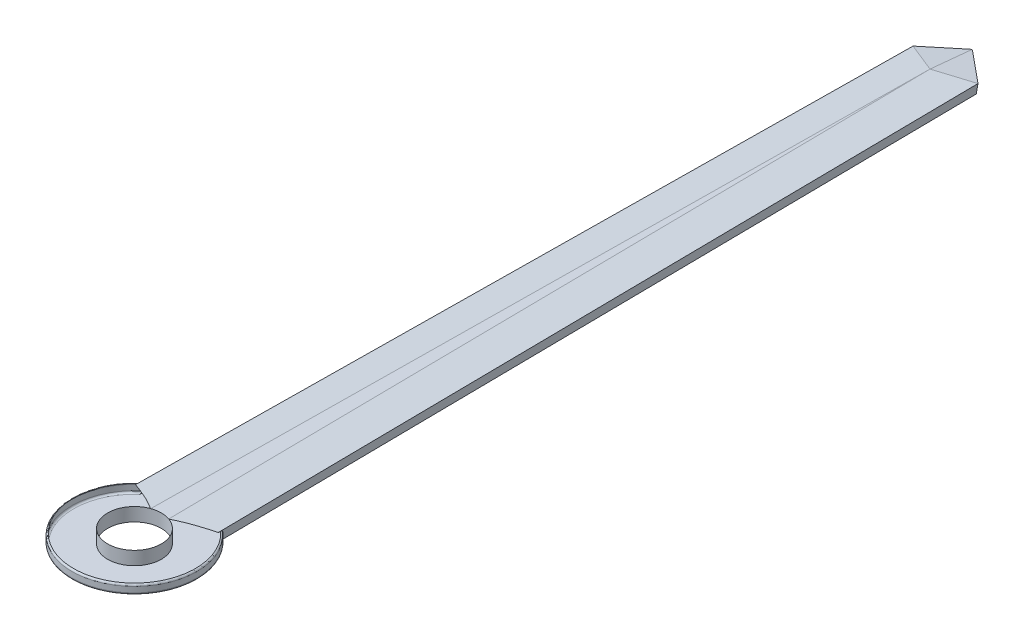
ISO-10303-21;
HEADER;
FILE_DESCRIPTION(('STEP AP214'),'2;1');
FILE_NAME('part.step','',(''),(''),'','','');
FILE_SCHEMA(('AUTOMOTIVE_DESIGN { 1 0 10303 214 1 1 1 1 }'));
ENDSEC;
DATA;
#1=APPLICATION_CONTEXT('core data for automotive mechanical design processes');
#2=APPLICATION_PROTOCOL_DEFINITION('international standard','automotive_design',2000,#1);
#3=PRODUCT_CONTEXT('',#1,'mechanical');
#4=PRODUCT('Part','Part','',(#3));
#5=PRODUCT_RELATED_PRODUCT_CATEGORY('part','',(#4));
#6=PRODUCT_DEFINITION_FORMATION('','',#4);
#7=PRODUCT_DEFINITION_CONTEXT('part definition',#1,'design');
#8=PRODUCT_DEFINITION('design','',#6,#7);
#9=PRODUCT_DEFINITION_SHAPE('','',#8);
#10=(LENGTH_UNIT() NAMED_UNIT(*) SI_UNIT(.MILLI.,.METRE.));
#11=(NAMED_UNIT(*) PLANE_ANGLE_UNIT() SI_UNIT($,.RADIAN.));
#12=(NAMED_UNIT(*) SI_UNIT($,.STERADIAN.) SOLID_ANGLE_UNIT());
#13=UNCERTAINTY_MEASURE_WITH_UNIT(LENGTH_MEASURE(1.E-05),#10,'distance_accuracy_value','');
#14=(GEOMETRIC_REPRESENTATION_CONTEXT(3) GLOBAL_UNCERTAINTY_ASSIGNED_CONTEXT((#13)) GLOBAL_UNIT_ASSIGNED_CONTEXT((#10,
#11,#12)) REPRESENTATION_CONTEXT('',''));
#15=CARTESIAN_POINT('',(0.,0.,0.));
#16=DIRECTION('',(0.,0.,1.));
#17=DIRECTION('',(1.,0.,0.));
#18=AXIS2_PLACEMENT_3D('',#15,#16,#17);
#19=CARTESIAN_POINT('',(0.,0.1905,0.));
#20=DIRECTION('',(0.,1.,0.));
#21=DIRECTION('',(0.,0.,1.));
#22=AXIS2_PLACEMENT_3D('',#19,#20,#21);
#23=PLANE('',#22);
#24=CARTESIAN_POINT('',(0.,0.1905,0.));
#25=DIRECTION('',(0.,1.,0.));
#26=DIRECTION('',(0.,0.,1.));
#27=AXIS2_PLACEMENT_3D('',#24,#25,#26);
#28=CIRCLE('',#27,0.380999999999999);
#29=CARTESIAN_POINT('',(0.127490264898993,0.1905,-0.359036533455837));
#30=VERTEX_POINT('',#29);
#31=CARTESIAN_POINT('',(-0.127490264898993,0.1905,-0.359036533455837));
#32=VERTEX_POINT('',#31);
#33=EDGE_CURVE('E159',#30,#32,#28,.T.);
#34=ORIENTED_EDGE('',*,*,#33,.F.);
#35=DIRECTION('',(-0.0116271209621439,0.,-0.999932402744371));
#36=VECTOR('',#35,1.);
#37=CARTESIAN_POINT('',(-0.00250040730988243,0.1905,-11.5382343434191));
#38=LINE('',#37,#36);
#39=CARTESIAN_POINT('',(0.000255235996342604,0.1905,-11.3012490190838));
#40=VERTEX_POINT('',#39);
#41=EDGE_CURVE('E198',#30,#40,#38,.T.);
#42=ORIENTED_EDGE('',*,*,#41,.T.);
#43=DIRECTION('',(-0.771288038730068,0.,-0.63648626168357));
#44=VECTOR('',#43,1.);
#45=CARTESIAN_POINT('',(-0.324948461460821,0.1905,-11.5696152782325));
#46=LINE('',#45,#44);
#47=CARTESIAN_POINT('',(0.,0.1905,-11.3014596462386));
#48=VERTEX_POINT('',#47);
#49=EDGE_CURVE('E194',#40,#48,#46,.T.);
#50=ORIENTED_EDGE('',*,*,#49,.T.);
#51=DIRECTION('',(-0.771288038730068,0.,0.63648626168357));
#52=VECTOR('',#51,1.);
#53=CARTESIAN_POINT('',(-0.183051538539177,0.1905,-11.1504009190061));
#54=LINE('',#53,#52);
#55=CARTESIAN_POINT('',(-0.000255235996342899,0.1905,-11.3012490190838));
#56=VERTEX_POINT('',#55);
#57=EDGE_CURVE('E191',#48,#56,#54,.T.);
#58=ORIENTED_EDGE('',*,*,#57,.T.);
#59=DIRECTION('',(-0.0116271209621439,0.,0.999932402744371));
#60=VECTOR('',#59,1.);
#61=CARTESIAN_POINT('',(-0.124499592690118,0.1905,-0.616234343419138));
#62=LINE('',#61,#60);
#63=EDGE_CURVE('E188',#56,#32,#62,.T.);
#64=ORIENTED_EDGE('',*,*,#63,.T.);
#65=EDGE_LOOP('',(#34,#42,#50,#58,#64));
#66=FACE_BOUND('',#65,.T.);
#67=ADVANCED_FACE('F36',(#66),#23,.T.);
#68=CARTESIAN_POINT('',(0.,0.,0.));
#69=DIRECTION('',(0.,1.,0.));
#70=DIRECTION('',(0.,0.,1.));
#71=AXIS2_PLACEMENT_3D('',#68,#69,#70);
#72=PLANE('',#71);
#73=DIRECTION('',(0.771288038730068,0.,-0.63648626168357));
#74=VECTOR('',#73,1.);
#75=CARTESIAN_POINT('',(-5.83257906208231,0.,-7.06786420437777));
#76=LINE('',#75,#74);
#77=CARTESIAN_POINT('',(-0.444847037542179,0.,-11.5139559924711));
#78=VERTEX_POINT('',#77);
#79=CARTESIAN_POINT('',(-0.0160431319088782,0.,-11.8678157454906));
#80=VERTEX_POINT('',#79);
#81=EDGE_CURVE('E153',#78,#80,#76,.T.);
#82=ORIENTED_EDGE('',*,*,#81,.T.);
#83=CARTESIAN_POINT('',(0.,0.,-11.8478692612338));
#84=DIRECTION('',(0.,1.,0.));
#85=DIRECTION('',(0.,0.,-1.));
#86=AXIS2_PLACEMENT_3D('',#83,#84,#85);
#87=ELLIPSE('',#86,0.0257281487250946,0.0254);
#88=CARTESIAN_POINT('',(0.0160431319088765,0.,-11.8678157454906));
#89=VERTEX_POINT('',#88);
#90=EDGE_CURVE('E336',#80,#89,#87,.F.);
#91=ORIENTED_EDGE('',*,*,#90,.T.);
#92=DIRECTION('',(0.771288038730068,0.,0.63648626168357));
#93=VECTOR('',#92,1.);
#94=CARTESIAN_POINT('',(5.83257906208231,0.,-7.06786420437777));
#95=LINE('',#94,#93);
#96=CARTESIAN_POINT('',(0.444847037542178,0.,-11.5139559924712));
#97=VERTEX_POINT('',#96);
#98=EDGE_CURVE('E178',#89,#97,#95,.T.);
#99=ORIENTED_EDGE('',*,*,#98,.T.);
#100=DIRECTION('',(0.0116271209621439,0.,0.999932402744371));
#101=VECTOR('',#100,1.);
#102=CARTESIAN_POINT('',(0.578652008248543,0.,-0.00672851172382027));
#103=LINE('',#102,#101);
#104=CARTESIAN_POINT('',(0.571198656038301,0.,-0.647716801804646));
#105=VERTEX_POINT('',#104);
#106=EDGE_CURVE('E182',#97,#105,#103,.T.);
#107=ORIENTED_EDGE('',*,*,#106,.T.);
#108=CARTESIAN_POINT('',(0.,0.,0.));
#109=DIRECTION('',(0.,1.,0.));
#110=DIRECTION('',(0.,0.,1.));
#111=AXIS2_PLACEMENT_3D('',#108,#109,#110);
#112=CIRCLE('',#111,0.8636);
#113=CARTESIAN_POINT('',(-0.571198656038301,0.,-0.647716801804646));
#114=VERTEX_POINT('',#113);
#115=EDGE_CURVE('E156',#105,#114,#112,.F.);
#116=ORIENTED_EDGE('',*,*,#115,.T.);
#117=DIRECTION('',(0.0116271209621439,0.,-0.999932402744371));
#118=VECTOR('',#117,1.);
#119=CARTESIAN_POINT('',(-0.578652008248543,0.,-0.00672851172382027));
#120=LINE('',#119,#118);
#121=EDGE_CURVE('E148',#114,#78,#120,.T.);
#122=ORIENTED_EDGE('',*,*,#121,.T.);
#123=EDGE_LOOP('',(#82,#91,#99,#107,#116,#122));
#124=FACE_BOUND('',#123,.T.);
#125=CARTESIAN_POINT('',(0.,0.,0.));
#126=DIRECTION('',(0.,1.,0.));
#127=DIRECTION('',(0.,0.,1.));
#128=AXIS2_PLACEMENT_3D('',#125,#126,#127);
#129=CIRCLE('',#128,0.380999999999999);
#130=CARTESIAN_POINT('',(0.,0.,0.380999999999999));
#131=VERTEX_POINT('',#130);
#132=EDGE_CURVE('E231',#131,#131,#129,.T.);
#133=ORIENTED_EDGE('',*,*,#132,.T.);
#134=EDGE_LOOP('',(#133));
#135=FACE_BOUND('',#134,.T.);
#136=ADVANCED_FACE('F150',(#124,#135),#72,.F.);
#137=CARTESIAN_POINT('',(0.,0.1905,0.));
#138=DIRECTION('',(0.,-1.,0.));
#139=DIRECTION('',(0.,0.,-1.));
#140=AXIS2_PLACEMENT_3D('',#137,#138,#139);
#141=CYLINDRICAL_SURFACE('',#140,0.889);
#142=CARTESIAN_POINT('',(0.,-4.65263034160604,0.));
#143=DIRECTION('',(-0.992286414925699,0.123428280262923,0.011538214127043));
#144=DIRECTION('',(-0.12341993684991,-0.992353495298595,0.0014351155447664));
#145=AXIS2_PLACEMENT_3D('',#142,#143,#144);
#146=ELLIPSE('',#145,7.20256328700588,0.889);
#147=CARTESIAN_POINT('',(0.573995985884059,0.0254000000000018,-0.678859048837818));
#148=VERTEX_POINT('',#147);
#149=CARTESIAN_POINT('',(0.583942218372925,0.10456351765091,-0.670322672749257));
#150=VERTEX_POINT('',#149);
#151=EDGE_CURVE('E201',#148,#150,#146,.F.);
#152=ORIENTED_EDGE('',*,*,#151,.T.);
#153=CARTESIAN_POINT('',(0.,0.104563517650909,0.));
#154=DIRECTION('',(0.,1.,0.));
#155=DIRECTION('',(0.,0.,1.));
#156=AXIS2_PLACEMENT_3D('',#153,#154,#155);
#157=CIRCLE('',#156,0.889);
#158=CARTESIAN_POINT('',(-0.583942218372925,0.104563517650912,-0.670322672749257));
#159=VERTEX_POINT('',#158);
#160=EDGE_CURVE('E333',#150,#159,#157,.F.);
#161=ORIENTED_EDGE('',*,*,#160,.T.);
#162=CARTESIAN_POINT('',(0.,-4.65263034160604,0.));
#163=DIRECTION('',(0.992286414925699,0.123428280262923,0.011538214127043));
#164=DIRECTION('',(0.12341993684991,-0.992353495298595,0.0014351155447664));
#165=AXIS2_PLACEMENT_3D('',#162,#163,#164);
#166=ELLIPSE('',#165,7.20256328700589,0.889);
#167=CARTESIAN_POINT('',(-0.573995985884059,0.0253999999999992,-0.678859048837818));
#168=VERTEX_POINT('',#167);
#169=EDGE_CURVE('E204',#159,#168,#166,.F.);
#170=ORIENTED_EDGE('',*,*,#169,.T.);
#171=CARTESIAN_POINT('',(0.,0.0254,0.));
#172=DIRECTION('',(0.,1.,0.));
#173=DIRECTION('',(0.,0.,1.));
#174=AXIS2_PLACEMENT_3D('',#171,#172,#173);
#175=CIRCLE('',#174,0.889);
#176=EDGE_CURVE('E335',#168,#148,#175,.T.);
#177=ORIENTED_EDGE('',*,*,#176,.T.);
#178=EDGE_LOOP('',(#152,#161,#170,#177));
#179=FACE_BOUND('',#178,.T.);
#180=ADVANCED_FACE('F310',(#179),#141,.T.);
#181=CARTESIAN_POINT('',(0.,0.1905,0.));
#182=DIRECTION('',(0.,-1.,0.));
#183=DIRECTION('',(0.,0.,-1.));
#184=AXIS2_PLACEMENT_3D('',#181,#182,#183);
#185=CYLINDRICAL_SURFACE('',#184,0.380999999999999);
#186=CARTESIAN_POINT('',(0.,0.190184708544504,0.));
#187=DIRECTION('',(0.,-1.,0.));
#188=DIRECTION('',(0.,0.,-1.));
#189=AXIS2_PLACEMENT_3D('',#186,#187,#188);
#190=CIRCLE('',#189,0.380999999999999);
#191=CARTESIAN_POINT('',(-0.130035983962558,0.190184708544504,-0.358122385330614));
#192=VERTEX_POINT('',#191);
#193=CARTESIAN_POINT('',(0.13003598396265,0.190184708544504,-0.358122385330581));
#194=VERTEX_POINT('',#193);
#195=EDGE_CURVE('E234',#192,#194,#190,.F.);
#196=ORIENTED_EDGE('',*,*,#195,.T.);
#197=CARTESIAN_POINT('',(0.,0.206875313262966,0.));
#198=DIRECTION('',(0.123419936849913,0.992353495298594,-0.00143511554476643));
#199=DIRECTION('',(0.992286414925698,-0.123428280262926,-0.011538214127043));
#200=AXIS2_PLACEMENT_3D('',#197,#198,#199);
#201=ELLIPSE('',#200,0.383935766644686,0.380999999999999);
#202=EDGE_CURVE('E237',#194,#30,#201,.T.);
#203=ORIENTED_EDGE('',*,*,#202,.T.);
#204=ORIENTED_EDGE('',*,*,#33,.T.);
#205=CARTESIAN_POINT('',(0.,0.206875313262966,0.));
#206=DIRECTION('',(-0.123419936849913,0.992353495298594,-0.00143511554476643));
#207=DIRECTION('',(-0.992286414925698,-0.123428280262926,-0.011538214127043));
#208=AXIS2_PLACEMENT_3D('',#205,#206,#207);
#209=ELLIPSE('',#208,0.383935766644686,0.380999999999999);
#210=EDGE_CURVE('E207',#32,#192,#209,.T.);
#211=ORIENTED_EDGE('',*,*,#210,.T.);
#212=EDGE_LOOP('',(#196,#203,#204,#211));
#213=FACE_BOUND('',#212,.T.);
#214=ORIENTED_EDGE('',*,*,#132,.F.);
#215=EDGE_LOOP('',(#214));
#216=FACE_BOUND('',#215,.T.);
#217=ADVANCED_FACE('F314',(#213,#216),#185,.F.);
#218=CARTESIAN_POINT('',(-0.131647308512932,0.1905,-0.00153078265712711));
#219=DIRECTION('',(-0.123419936849913,0.992353495298594,-0.00143511554476643));
#220=DIRECTION('',(-0.992354517204281,-0.123420063945284,0.));
#221=AXIS2_PLACEMENT_3D('',#218,#219,#220);
#222=PLANE('',#221);
#223=DIRECTION('',(-0.0116271209621439,0.,0.999932402744371));
#224=VECTOR('',#223,1.);
#225=CARTESIAN_POINT('',(-0.588026098472768,0.132842978192118,-0.621624186509634));
#226=LINE('',#225,#224);
#227=CARTESIAN_POINT('',(-0.588248862316324,0.132842978192118,-0.602466495963819));
#228=VERTEX_POINT('',#227);
#229=CARTESIAN_POINT('',(-0.461279660106525,0.132842978192118,-11.5218178860066));
#230=VERTEX_POINT('',#229);
#231=EDGE_CURVE('E166',#228,#230,#226,.F.);
#232=ORIENTED_EDGE('',*,*,#231,.F.);
#233=CARTESIAN_POINT('',(-0.588248862316324,0.132842978192118,-0.602466495963819));
#234=CARTESIAN_POINT('',(-0.548193220507443,0.137849566828459,-0.585296484566291));
#235=CARTESIAN_POINT('',(-0.508362668731256,0.142828974169535,-0.567564048589156));
#236=CARTESIAN_POINT('',(-0.429495899396567,0.15269108663912,-0.530654066274168));
#237=CARTESIAN_POINT('',(-0.390457882077916,0.157574009984259,-0.511480406905702));
#238=CARTESIAN_POINT('',(-0.313215901142291,0.167238871748706,-0.4712335121522));
#239=CARTESIAN_POINT('',(-0.27501417868527,0.172020537903475,-0.450155802456047));
#240=CARTESIAN_POINT('',(-0.200026951377842,0.181411521945662,-0.405381024593189));
#241=CARTESIAN_POINT('',(-0.163245533047501,0.186020341559049,-0.381677062156839));
#242=CARTESIAN_POINT('',(-0.127521687784073,0.190500000000005,-0.356334165335821));
#243=B_SPLINE_CURVE_WITH_KNOTS('',3,(#233,#234,#235,#236,#237,#238,#239,#240,#241,#242),
.UNSPECIFIED.,.F.,.F.,(4,2,2,2,4),(0.,0.131612085498327,0.262881139686943,0.394467111305991,
0.526407086773529),.UNSPECIFIED.);
#244=EDGE_CURVE('E353',#228,#192,#243,.T.);
#245=ORIENTED_EDGE('',*,*,#244,.T.);
#246=ORIENTED_EDGE('',*,*,#210,.F.);
#247=ORIENTED_EDGE('',*,*,#63,.F.);
#248=DIRECTION('',(-0.896387779973205,-0.112104797653588,-0.428860655991847));
#249=VECTOR('',#248,1.);
#250=CARTESIAN_POINT('',(4.23806906466026,0.72055685567199,-9.27349877471953));
#251=LINE('',#250,#249);
#252=EDGE_CURVE('E227',#230,#56,#251,.F.);
#253=ORIENTED_EDGE('',*,*,#252,.F.);
#254=EDGE_LOOP('',(#232,#245,#246,#247,#253));
#255=FACE_BOUND('',#254,.T.);
#256=ADVANCED_FACE('F357',(#255),#222,.T.);
#257=CARTESIAN_POINT('',(-5.5480474782384,0.1905,-6.72307151917629));
#258=DIRECTION('',(-0.0785604046905817,0.992353495298594,-0.0951987562078173));
#259=DIRECTION('',(0.,0.0954938938986421,0.995430015735951));
#260=AXIS2_PLACEMENT_3D('',#257,#258,#259);
#261=PLANE('',#260);
#262=DIRECTION('',(0.,-0.0954938938986422,-0.99543001573595));
#263=VECTOR('',#262,1.);
#264=CARTESIAN_POINT('',(0.,0.625710075849527,-6.76482222404737));
#265=LINE('',#264,#263);
#266=CARTESIAN_POINT('',(0.,0.133547497242996,-11.8951335284219));
#267=VERTEX_POINT('',#266);
#268=EDGE_CURVE('E222',#267,#48,#265,.F.);
#269=ORIENTED_EDGE('',*,*,#268,.F.);
#270=CARTESIAN_POINT('',(0.,0.135978056510796,-11.8697973362172));
#271=DIRECTION('',(-0.0785604046905817,0.992353495298594,-0.0951987562078173));
#272=DIRECTION('',(0.771288038730088,0.,-0.636486261683545));
#273=AXIS2_PLACEMENT_3D('',#270,#271,#272);
#274=ELLIPSE('',#273,0.0255314183149097,0.0254);
#275=CARTESIAN_POINT('',(-0.0160431319088771,0.132842978192118,-11.8892382518975));
#276=VERTEX_POINT('',#275);
#277=EDGE_CURVE('E344',#267,#276,#274,.T.);
#278=ORIENTED_EDGE('',*,*,#277,.T.);
#279=DIRECTION('',(-0.771288038730068,0.,0.63648626168357));
#280=VECTOR('',#279,1.);
#281=CARTESIAN_POINT('',(-0.478099735844441,0.132842978192118,-11.5079375370448));
#282=LINE('',#281,#280);
#283=EDGE_CURVE('E171',#230,#276,#282,.F.);
#284=ORIENTED_EDGE('',*,*,#283,.F.);
#285=ORIENTED_EDGE('',*,*,#252,.T.);
#286=ORIENTED_EDGE('',*,*,#57,.F.);
#287=EDGE_LOOP('',(#269,#278,#284,#285,#286));
#288=FACE_BOUND('',#287,.T.);
#289=ADVANCED_FACE('F273',(#288),#261,.T.);
#290=CARTESIAN_POINT('',(-0.635,0.510534918069288,-0.622170394666927));
#291=DIRECTION('',(0.992286414925699,0.123428280262923,0.011538214127043));
#292=DIRECTION('',(-0.123436497110616,0.992352473257895,0.));
#293=AXIS2_PLACEMENT_3D('',#290,#291,#292);
#294=PLANE('',#293);
#295=ORIENTED_EDGE('',*,*,#169,.F.);
#296=CARTESIAN_POINT('',(-0.583942218372925,0.104563517650909,-0.670322672749257));
#297=CARTESIAN_POINT('',(-0.584104249927129,0.105853117583221,-0.670183257053217));
#298=CARTESIAN_POINT('',(-0.584265342745076,0.107122761098843,-0.669911091961102));
#299=CARTESIAN_POINT('',(-0.584580049900082,0.109580953005702,-0.669142408447812));
#300=CARTESIAN_POINT('',(-0.584733719672291,0.110770143439963,-0.668647990760664));
#301=CARTESIAN_POINT('',(-0.585030417453713,0.113045736475916,-0.667474789891916));
#302=CARTESIAN_POINT('',(-0.585173493052339,0.11413260555371,-0.666796904077463));
#303=CARTESIAN_POINT('',(-0.585448283233792,0.116200939100631,-0.665290630133141));
#304=CARTESIAN_POINT('',(-0.585579966831143,0.117182117770456,-0.664461849459796));
#305=CARTESIAN_POINT('',(-0.585892627948483,0.119488657882759,-0.662246853316463));
#306=CARTESIAN_POINT('',(-0.586065857048017,0.120744880618033,-0.660787401263488));
#307=CARTESIAN_POINT('',(-0.586383512277623,0.12300849941694,-0.657683767282133));
#308=CARTESIAN_POINT('',(-0.586527875948282,0.12401535699983,-0.656039196547951));
#309=CARTESIAN_POINT('',(-0.586826626763701,0.126050538582397,-0.652117670016126));
#310=CARTESIAN_POINT('',(-0.586971339698861,0.126997056242895,-0.649797585447162));
#311=CARTESIAN_POINT('',(-0.587213829203313,0.128501539785394,-0.645037470572332));
#312=CARTESIAN_POINT('',(-0.587311663284962,0.129059982150471,-0.6425975913086));
#313=CARTESIAN_POINT('',(-0.587414829502616,0.129570068732687,-0.639181869759658));
#314=CARTESIAN_POINT('',(-0.587440036875009,0.12968364766395,-0.638229028973402));
#315=CARTESIAN_POINT('',(-0.587461793826662,0.129769296430835,-0.637274145710641));
#316=B_SPLINE_CURVE_WITH_KNOTS('',3,(#296,#297,#298,#299,#300,#301,#302,#303,#304,#305,#306,
#307,#308,#309,#310,#311,#312,#313,#314,#315),.UNSPECIFIED.,.F.,.F.,(4,2,2,2,2,2,2,2,2,4),(0.,
0.00390675921132828,0.00777734379610161,0.0116293286702409,0.0154914812627117,0.021259819248556,
0.027040506893482,0.0345317102156363,0.0420136994279959,0.044891536435234),.UNSPECIFIED.);
#317=CARTESIAN_POINT('',(-0.587461793826662,0.129769296430836,-0.637274145710624));
#318=VERTEX_POINT('',#317);
#319=EDGE_CURVE('E64',#159,#318,#316,.T.);
#320=ORIENTED_EDGE('',*,*,#319,.T.);
#321=CARTESIAN_POINT('',(-0.586761723930837,0.126999999999996,-0.667856031888394));
#322=CARTESIAN_POINT('',(-0.58701258294032,0.127998178635317,-0.656960020301663));
#323=CARTESIAN_POINT('',(-0.587261940639642,0.128984182785995,-0.646062886702011));
#324=CARTESIAN_POINT('',(-0.587757653435011,0.130931842185044,-0.624266374727307));
#325=CARTESIAN_POINT('',(-0.588004008530851,0.13189349743174,-0.613366996352101));
#326=CARTESIAN_POINT('',(-0.588248862316324,0.132842978192118,-0.602466495963819));
#327=B_SPLINE_CURVE_WITH_KNOTS('',3,(#321,#322,#323,#324,#325,#326),.UNSPECIFIED.,.F.,.F.,(4,2,
4),(0.,0.0328334758626683,0.0656669539835402),.UNSPECIFIED.);
#328=EDGE_CURVE('E276',#318,#228,#327,.T.);
#329=ORIENTED_EDGE('',*,*,#328,.T.);
#330=ORIENTED_EDGE('',*,*,#231,.T.);
#331=DIRECTION('',(0.122552715498221,-0.990728512662257,0.0586331486622009));
#332=VECTOR('',#331,1.);
#333=CARTESIAN_POINT('',(-0.431425747715019,-0.10849906062395,-11.5075348170735));
#334=LINE('',#333,#332);
#335=EDGE_CURVE('E163',#78,#230,#334,.F.);
#336=ORIENTED_EDGE('',*,*,#335,.F.);
#337=ORIENTED_EDGE('',*,*,#121,.F.);
#338=CARTESIAN_POINT('',(-0.571198656038301,0.,-0.647716801804646));
#339=CARTESIAN_POINT('',(-0.571173985481209,1.23472504545118E-06,-0.649851677996783));
#340=CARTESIAN_POINT('',(-0.571167424126858,0.000148735256892394,-0.651993818842631));
#341=CARTESIAN_POINT('',(-0.571194916383691,0.000767562435153503,-0.656249293813108));
#342=CARTESIAN_POINT('',(-0.571229335994081,0.00124179104113898,-0.658362195274561));
#343=CARTESIAN_POINT('',(-0.571331697233564,0.0024085772214167,-0.662040645322824));
#344=CARTESIAN_POINT('',(-0.571391019168623,0.00303383097806176,-0.663627515304839));
#345=CARTESIAN_POINT('',(-0.571540624321738,0.00452200713404006,-0.666681008872747));
#346=CARTESIAN_POINT('',(-0.571630810317335,0.0053841815676792,-0.668147992341435));
#347=CARTESIAN_POINT('',(-0.571821781332556,0.00714969432872987,-0.670610787668139));
#348=CARTESIAN_POINT('',(-0.571916314353619,0.00800595859600489,-0.671640703846419));
#349=CARTESIAN_POINT('',(-0.572126406192652,0.00987320945937861,-0.673547436108814));
#350=CARTESIAN_POINT('',(-0.572241942151081,0.0108840276511603,-0.674424416634072));
#351=CARTESIAN_POINT('',(-0.572473946009436,0.012883518496956,-0.675861332213842));
#352=CARTESIAN_POINT('',(-0.572587628248466,0.01385240366094,-0.676449160458318));
#353=CARTESIAN_POINT('',(-0.572827391264135,0.0158738370221022,-0.677453515210049));
#354=CARTESIAN_POINT('',(-0.572953463101079,0.0169263247923461,-0.677870164123105));
#355=CARTESIAN_POINT('',(-0.57322821264777,0.01919795402351,-0.678542109245978));
#356=CARTESIAN_POINT('',(-0.573377885937935,0.0204231663936128,-0.678776728161864));
#357=CARTESIAN_POINT('',(-0.573683739734442,0.0229032812319451,-0.679003950684685));
#358=CARTESIAN_POINT('',(-0.573839956844846,0.0241583268090005,-0.678994937226952));
#359=CARTESIAN_POINT('',(-0.573995985881224,0.0253999999827562,-0.678859048897214));
#360=B_SPLINE_CURVE_WITH_KNOTS('',3,(#338,#339,#340,#341,#342,#343,#344,#345,#346,#347,#348,
#349,#350,#351,#352,#353,#354,#355,#356,#357,#358,#359),.UNSPECIFIED.,.F.,.F.,(4,2,2,2,2,2,2,2,
2,2,4),(0.,0.00641153917337711,0.0128807716605205,0.0179830909363638,0.0230694835189735,
0.0270826019222974,0.0310913783286584,0.0344936441983647,0.0378934729457264,0.0416384890004196,
0.0454083679706358),.UNSPECIFIED.);
#361=EDGE_CURVE('E11',#114,#168,#360,.T.);
#362=ORIENTED_EDGE('',*,*,#361,.T.);
#363=EDGE_LOOP('',(#295,#320,#329,#330,#336,#337,#362));
#364=FACE_BOUND('',#363,.T.);
#365=ADVANCED_FACE('F164',(#364),#294,.F.);
#366=CARTESIAN_POINT('',(5.5480474782384,0.1905,-6.72307151917629));
#367=DIRECTION('',(0.0785604046905819,0.992353495298594,-0.0951987562078176));
#368=DIRECTION('',(0.,0.0954938938986423,0.995430015735951));
#369=AXIS2_PLACEMENT_3D('',#366,#367,#368);
#370=PLANE('',#369);
#371=DIRECTION('',(-0.771288038730068,0.,-0.63648626168357));
#372=VECTOR('',#371,1.);
#373=CARTESIAN_POINT('',(-0.0299002641555591,0.132842978192118,-11.9271518962712));
#374=LINE('',#373,#372);
#375=CARTESIAN_POINT('',(0.0160431319088775,0.132842978192118,-11.8892382518975));
#376=VERTEX_POINT('',#375);
#377=CARTESIAN_POINT('',(0.461279660106525,0.132842978192118,-11.5218178860066));
#378=VERTEX_POINT('',#377);
#379=EDGE_CURVE('E215',#376,#378,#374,.F.);
#380=ORIENTED_EDGE('',*,*,#379,.F.);
#381=CARTESIAN_POINT('',(0.,0.135978056510797,-11.8697973362172));
#382=DIRECTION('',(0.0785604046905819,0.992353495298594,-0.0951987562078176));
#383=DIRECTION('',(-0.771288038730095,0.,-0.636486261683536));
#384=AXIS2_PLACEMENT_3D('',#381,#382,#383);
#385=ELLIPSE('',#384,0.0255314183149097,0.0254);
#386=EDGE_CURVE('E347',#376,#267,#385,.T.);
#387=ORIENTED_EDGE('',*,*,#386,.T.);
#388=ORIENTED_EDGE('',*,*,#268,.T.);
#389=ORIENTED_EDGE('',*,*,#49,.F.);
#390=DIRECTION('',(0.896387779973206,-0.112104797653588,-0.428860655991844));
#391=VECTOR('',#390,1.);
#392=CARTESIAN_POINT('',(2.69799966558342,-0.146887568368004,-12.5919364555029));
#393=LINE('',#392,#391);
#394=EDGE_CURVE('E172',#378,#40,#393,.F.);
#395=ORIENTED_EDGE('',*,*,#394,.F.);
#396=EDGE_LOOP('',(#380,#387,#388,#389,#395));
#397=FACE_BOUND('',#396,.T.);
#398=ADVANCED_FACE('F267',(#397),#370,.T.);
#399=CARTESIAN_POINT('',(-0.508,0.510534918069288,-11.5441703946669));
#400=DIRECTION('',(0.631619366491226,0.123428280262923,0.76539038111578));
#401=DIRECTION('',(0.771288038730068,0.,-0.63648626168357));
#402=AXIS2_PLACEMENT_3D('',#399,#400,#401);
#403=PLANE('',#402);
#404=ORIENTED_EDGE('',*,*,#283,.T.);
#405=DIRECTION('',(0.,-0.987245536839792,0.159205056420677));
#406=VECTOR('',#405,1.);
#407=CARTESIAN_POINT('',(-0.0160431319088775,0.446725982236157,-11.9398556105014));
#408=LINE('',#407,#406);
#409=EDGE_CURVE('E176',#276,#80,#408,.T.);
#410=ORIENTED_EDGE('',*,*,#409,.T.);
#411=ORIENTED_EDGE('',*,*,#81,.F.);
#412=ORIENTED_EDGE('',*,*,#335,.T.);
#413=EDGE_LOOP('',(#404,#410,#411,#412));
#414=FACE_BOUND('',#413,.T.);
#415=ADVANCED_FACE('F174',(#414),#403,.F.);
#416=CARTESIAN_POINT('',(0.131647308512932,0.1905,-0.00153078265712711));
#417=DIRECTION('',(0.123419936849913,0.992353495298594,-0.00143511554476643));
#418=DIRECTION('',(-0.992354517204281,0.123420063945284,0.));
#419=AXIS2_PLACEMENT_3D('',#416,#417,#418);
#420=PLANE('',#419);
#421=ORIENTED_EDGE('',*,*,#41,.F.);
#422=ORIENTED_EDGE('',*,*,#202,.F.);
#423=CARTESIAN_POINT('',(0.12752168778411,0.1905,-0.356334165335732));
#424=CARTESIAN_POINT('',(0.179523864309788,0.183979439635741,-0.392983148835548));
#425=CARTESIAN_POINT('',(0.233528599182533,0.177214511526552,-0.426387488425012));
#426=CARTESIAN_POINT('',(0.344031744034589,0.163381590620062,-0.488303236401294));
#427=CARTESIAN_POINT('',(0.400521244071694,0.156314682916234,-0.516830579535874));
#428=CARTESIAN_POINT('',(0.479249261012418,0.146469448175179,-0.554002658378174));
#429=CARTESIAN_POINT('',(0.500910347290855,0.143761029718878,-0.563966052133203));
#430=CARTESIAN_POINT('',(0.544436428431832,0.138319396069531,-0.583503145451653));
#431=CARTESIAN_POINT('',(0.566301637923232,0.135586154884375,-0.593076359953089));
#432=CARTESIAN_POINT('',(0.58824886231639,0.13284297819211,-0.602466495963848));
#433=B_SPLINE_CURVE_WITH_KNOTS('',3,(#423,#424,#425,#426,#427,#428,#429,#430,#431,#432),
.UNSPECIFIED.,.F.,.F.,(4,2,2,2,4),(0.,0.191458446972412,0.382278857510023,0.454267917685656,
0.526343901008368),.UNSPECIFIED.);
#434=CARTESIAN_POINT('',(0.588248862316322,0.132842978192118,-0.602466495963993));
#435=VERTEX_POINT('',#434);
#436=EDGE_CURVE('E240',#194,#435,#433,.T.);
#437=ORIENTED_EDGE('',*,*,#436,.T.);
#438=DIRECTION('',(-0.0116271209621439,0.,-0.999932402744371));
#439=VECTOR('',#438,1.);
#440=CARTESIAN_POINT('',(0.461026098472768,0.132842978192118,-11.5436241865096));
#441=LINE('',#440,#439);
#442=EDGE_CURVE('E212',#378,#435,#441,.F.);
#443=ORIENTED_EDGE('',*,*,#442,.F.);
#444=ORIENTED_EDGE('',*,*,#394,.T.);
#445=EDGE_LOOP('',(#421,#422,#437,#443,#444));
#446=FACE_BOUND('',#445,.T.);
#447=ADVANCED_FACE('F258',(#446),#420,.T.);
#448=CARTESIAN_POINT('',(0.,0.510534918069288,-11.9633847538934));
#449=DIRECTION('',(-0.631619366491226,0.123428280262922,0.765390381115781));
#450=DIRECTION('',(0.771288038730068,0.,0.63648626168357));
#451=AXIS2_PLACEMENT_3D('',#448,#449,#450);
#452=PLANE('',#451);
#453=ORIENTED_EDGE('',*,*,#98,.F.);
#454=DIRECTION('',(0.,-0.987245536839792,0.159205056420677));
#455=VECTOR('',#454,1.);
#456=CARTESIAN_POINT('',(0.0160431319088772,0.512615781740341,-11.9504811224497));
#457=LINE('',#456,#455);
#458=EDGE_CURVE('E350',#89,#376,#457,.F.);
#459=ORIENTED_EDGE('',*,*,#458,.T.);
#460=ORIENTED_EDGE('',*,*,#379,.T.);
#461=DIRECTION('',(-0.122552715498221,-0.990728512662257,0.0586331486621997));
#462=VECTOR('',#461,1.);
#463=CARTESIAN_POINT('',(0.503382590942968,0.473207317543837,-11.54196127812));
#464=LINE('',#463,#462);
#465=EDGE_CURVE('E208',#97,#378,#464,.F.);
#466=ORIENTED_EDGE('',*,*,#465,.F.);
#467=EDGE_LOOP('',(#453,#459,#460,#466));
#468=FACE_BOUND('',#467,.T.);
#469=ADVANCED_FACE('F263',(#468),#452,.F.);
#470=CARTESIAN_POINT('',(0.508,0.510534918069288,-11.5441703946669));
#471=DIRECTION('',(-0.992286414925699,0.123428280262923,0.011538214127043));
#472=DIRECTION('',(-0.123436497110616,-0.992352473257895,0.));
#473=AXIS2_PLACEMENT_3D('',#470,#471,#472);
#474=PLANE('',#473);
#475=ORIENTED_EDGE('',*,*,#151,.F.);
#476=CARTESIAN_POINT('',(0.573995985884059,0.0254,-0.678859048837818));
#477=CARTESIAN_POINT('',(0.573858614463925,0.0243066949276383,-0.678977527234792));
#478=CARTESIAN_POINT('',(0.573721079368415,0.0232030134282763,-0.678999081473847));
#479=CARTESIAN_POINT('',(0.573450269253389,0.0210120665416885,-0.678851432264446));
#480=CARTESIAN_POINT('',(0.57331698049174,0.0199247558748869,-0.678682926268013));
#481=CARTESIAN_POINT('',(0.573058068766036,0.0177942742207744,-0.678158833150036));
#482=CARTESIAN_POINT('',(0.572932452849961,0.0167511440777955,-0.677803076828158));
#483=CARTESIAN_POINT('',(0.572692266004709,0.0147378799519829,-0.67692256056593));
#484=CARTESIAN_POINT('',(0.572577698223088,0.0137677667884891,-0.676397752647394));
#485=CARTESIAN_POINT('',(0.572360265568612,0.0119073525967855,-0.675195464762214));
#486=CARTESIAN_POINT('',(0.572257583744161,0.0110183357882597,-0.674515980376457));
#487=CARTESIAN_POINT('',(0.572066752669052,0.00934584964164512,-0.673036288174918));
#488=CARTESIAN_POINT('',(0.571978612818721,0.00856244863584311,-0.672236002905154));
#489=CARTESIAN_POINT('',(0.571779938113091,0.00677032237312034,-0.67015103109142));
#490=CARTESIAN_POINT('',(0.571677677101408,0.00582308393554493,-0.668812539838825));
#491=CARTESIAN_POINT('',(0.571502952062893,0.00415535246470472,-0.665998590906806));
#492=CARTESIAN_POINT('',(0.57143055914319,0.00343540148101112,-0.664522816506595));
#493=CARTESIAN_POINT('',(0.571294391968452,0.00201050713227311,-0.66099060424902));
#494=CARTESIAN_POINT('',(0.571241055841017,0.00138640417116661,-0.658901265270516));
#495=CARTESIAN_POINT('',(0.571177808115013,0.000480809591655116,-0.654653110249635));
#496=CARTESIAN_POINT('',(0.571167870533442,0.000199113045151655,-0.652494336558481));
#497=CARTESIAN_POINT('',(0.571181480540977,2.47222675849728E-05,-0.649458357249416));
#498=CARTESIAN_POINT('',(0.5711885494495,1.20562527707044E-07,-0.648587258140736));
#499=CARTESIAN_POINT('',(0.571198656038301,0.,-0.647716801804646));
#500=B_SPLINE_CURVE_WITH_KNOTS('',3,(#476,#477,#478,#479,#480,#481,#482,#483,#484,#485,#486,
#487,#488,#489,#490,#491,#492,#493,#494,#495,#496,#497,#498,#499),.UNSPECIFIED.,.F.,.F.,(4,2,2,
2,2,2,2,2,2,2,2,4),(0.,0.00332060818450834,0.00662907047593216,0.00994052745581145,
0.013252925082769,0.0166109736180634,0.0199711844536158,0.0248727990797086,0.0297860165932265,
0.0362951964884905,0.0428004787590775,0.0454131118642467),.UNSPECIFIED.);
#501=EDGE_CURVE('E49',#148,#105,#500,.T.);
#502=ORIENTED_EDGE('',*,*,#501,.T.);
#503=ORIENTED_EDGE('',*,*,#106,.F.);
#504=ORIENTED_EDGE('',*,*,#465,.T.);
#505=ORIENTED_EDGE('',*,*,#442,.T.);
#506=CARTESIAN_POINT('',(0.588248862316322,0.132842978192118,-0.602466495963993));
#507=CARTESIAN_POINT('',(0.588004008530849,0.131893497431734,-0.613366996352246));
#508=CARTESIAN_POINT('',(0.587757653435008,0.130931842185036,-0.624266374727422));
#509=CARTESIAN_POINT('',(0.58726194063964,0.128984182785987,-0.646062886702068));
#510=CARTESIAN_POINT('',(0.587012582940319,0.127998178635312,-0.656960020301692));
#511=CARTESIAN_POINT('',(0.586761723930838,0.126999999999996,-0.667856031888394));
#512=B_SPLINE_CURVE_WITH_KNOTS('',3,(#506,#507,#508,#509,#510,#511),.UNSPECIFIED.,.F.,.F.,(4,2,
4),(0.,0.0328334781207852,0.0656669539833668),.UNSPECIFIED.);
#513=CARTESIAN_POINT('',(0.587461793826734,0.129769296431119,-0.637274145707469));
#514=VERTEX_POINT('',#513);
#515=EDGE_CURVE('E248',#435,#514,#512,.T.);
#516=ORIENTED_EDGE('',*,*,#515,.T.);
#517=CARTESIAN_POINT('',(0.58746179382236,0.129769296431494,-0.637274145707403));
#518=CARTESIAN_POINT('',(0.587401920930439,0.129532475161845,-0.639889855359205));
#519=CARTESIAN_POINT('',(0.587316422873098,0.129088601265363,-0.642494415295554));
#520=CARTESIAN_POINT('',(0.58709261066205,0.127767631513364,-0.64761139370623));
#521=CARTESIAN_POINT('',(0.58695385648256,0.126886907997167,-0.650122848051625));
#522=CARTESIAN_POINT('',(0.586665596761128,0.124961472514371,-0.654316132597006));
#523=CARTESIAN_POINT('',(0.586528079906473,0.124017534843586,-0.656044953292311));
#524=CARTESIAN_POINT('',(0.586223075351222,0.12187255851562,-0.659329788962793));
#525=CARTESIAN_POINT('',(0.586055666881845,0.120672197924436,-0.66088624356041));
#526=CARTESIAN_POINT('',(0.585735243626367,0.11833162406067,-0.663404712733941));
#527=CARTESIAN_POINT('',(0.585588575489816,0.117247354791737,-0.664419367867698));
#528=CARTESIAN_POINT('',(0.58527949731923,0.114934622335843,-0.666259988942266));
#529=CARTESIAN_POINT('',(0.585117142322078,0.113706660302976,-0.667086582730375));
#530=CARTESIAN_POINT('',(0.584790055048169,0.11120482901971,-0.668453130917027));
#531=CARTESIAN_POINT('',(0.584626198241146,0.109939437771753,-0.669008487052457));
#532=CARTESIAN_POINT('',(0.584289429923708,0.107312552293009,-0.669869856860081));
#533=CARTESIAN_POINT('',(0.584116436960376,0.105950132949105,-0.670172979227055));
#534=CARTESIAN_POINT('',(0.583942218372925,0.104563517650909,-0.670322672749257));
#535=B_SPLINE_CURVE_WITH_KNOTS('',3,(#517,#518,#519,#520,#521,#522,#523,#524,#525,#526,#527,
#528,#529,#530,#531,#532,#533,#534),.UNSPECIFIED.,.F.,.F.,(4,2,2,2,2,2,2,2,4),(0.,
0.00788663899635556,0.0158398946908899,0.0217432585618111,0.0276312010853114,0.0320919829161533,
0.0365376463412517,0.0406877832856139,0.0448848614950803),.UNSPECIFIED.);
#536=EDGE_CURVE('E287',#514,#150,#535,.T.);
#537=ORIENTED_EDGE('',*,*,#536,.T.);
#538=EDGE_LOOP('',(#475,#502,#503,#504,#505,#516,#537));
#539=FACE_BOUND('',#538,.T.);
#540=ADVANCED_FACE('F303',(#539),#474,.F.);
#541=CARTESIAN_POINT('',(0.,0.1905,0.));
#542=DIRECTION('',(0.,-1.,0.));
#543=DIRECTION('',(0.,0.,-1.));
#544=AXIS2_PLACEMENT_3D('',#541,#542,#543);
#545=CONICAL_SURFACE('',#544,0.378465081930712,1.4470524828285);
#546=ORIENTED_EDGE('',*,*,#328,.F.);
#547=CARTESIAN_POINT('',(0.,0.129769296431494,0.));
#548=DIRECTION('',(0.,-1.,0.));
#549=DIRECTION('',(0.,0.,-1.));
#550=AXIS2_PLACEMENT_3D('',#547,#548,#549);
#551=CIRCLE('',#550,0.866735078318678);
#552=EDGE_CURVE('E56',#318,#514,#551,.F.);
#553=ORIENTED_EDGE('',*,*,#552,.T.);
#554=ORIENTED_EDGE('',*,*,#515,.F.);
#555=ORIENTED_EDGE('',*,*,#436,.F.);
#556=ORIENTED_EDGE('',*,*,#195,.F.);
#557=ORIENTED_EDGE('',*,*,#244,.F.);
#558=EDGE_LOOP('',(#546,#553,#554,#555,#556,#557));
#559=FACE_BOUND('',#558,.T.);
#560=ADVANCED_FACE('F254',(#559),#545,.T.);
#561=CARTESIAN_POINT('',(0.,0.51575086005902,-11.9310402067694));
#562=DIRECTION('',(0.,0.987245536839792,-0.159205056420677));
#563=DIRECTION('',(0.,0.159205056420677,0.987245536839792));
#564=AXIS2_PLACEMENT_3D('',#561,#562,#563);
#565=CYLINDRICAL_SURFACE('',#564,0.0254);
#566=ORIENTED_EDGE('',*,*,#90,.F.);
#567=ORIENTED_EDGE('',*,*,#409,.F.);
#568=ORIENTED_EDGE('',*,*,#277,.F.);
#569=ORIENTED_EDGE('',*,*,#386,.F.);
#570=ORIENTED_EDGE('',*,*,#458,.F.);
#571=EDGE_LOOP('',(#566,#567,#568,#569,#570));
#572=FACE_BOUND('',#571,.T.);
#573=ADVANCED_FACE('F295',(#572),#565,.T.);
#574=CARTESIAN_POINT('',(0.,0.104563517650909,0.));
#575=DIRECTION('',(0.,1.,0.));
#576=DIRECTION('',(0.,0.,1.));
#577=AXIS2_PLACEMENT_3D('',#574,#575,#576);
#578=TOROIDAL_SURFACE('',#577,0.8636,0.0254);
#579=ORIENTED_EDGE('',*,*,#536,.F.);
#580=ORIENTED_EDGE('',*,*,#552,.F.);
#581=ORIENTED_EDGE('',*,*,#319,.F.);
#582=ORIENTED_EDGE('',*,*,#160,.F.);
#583=EDGE_LOOP('',(#579,#580,#581,#582));
#584=FACE_BOUND('',#583,.T.);
#585=ADVANCED_FACE('F292',(#584),#578,.T.);
#586=CARTESIAN_POINT('',(0.,0.0254,0.));
#587=DIRECTION('',(0.,1.,0.));
#588=DIRECTION('',(0.,0.,1.));
#589=AXIS2_PLACEMENT_3D('',#586,#587,#588);
#590=TOROIDAL_SURFACE('',#589,0.8636,0.0254);
#591=ORIENTED_EDGE('',*,*,#361,.F.);
#592=ORIENTED_EDGE('',*,*,#115,.F.);
#593=ORIENTED_EDGE('',*,*,#501,.F.);
#594=ORIENTED_EDGE('',*,*,#176,.F.);
#595=EDGE_LOOP('',(#591,#592,#593,#594));
#596=FACE_BOUND('',#595,.T.);
#597=ADVANCED_FACE('F38',(#596),#590,.T.);
#598=CLOSED_SHELL('',(#67,#136,#180,#217,#256,#289,#365,#398,#415,#447,#469,#540,#560,#573,#585,#597));
#599=MANIFOLD_SOLID_BREP('B2',#598);
#600=ADVANCED_BREP_SHAPE_REPRESENTATION('',(#18,#599),#14);
#601=SHAPE_DEFINITION_REPRESENTATION(#9,#600);
ENDSEC;
END-ISO-10303-21;
